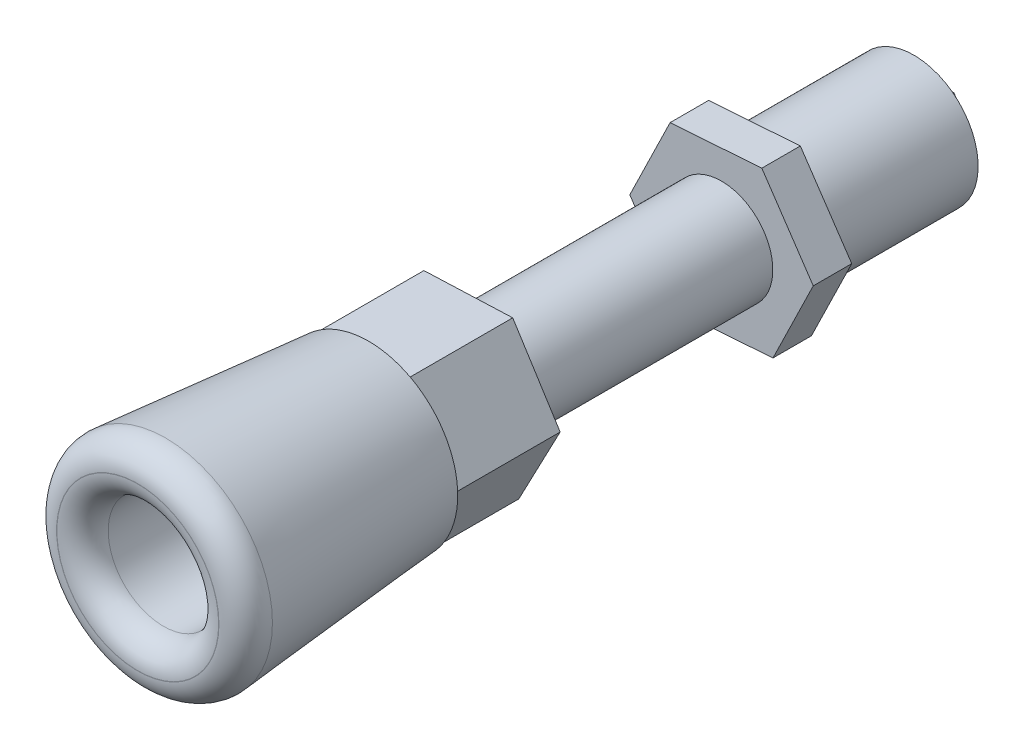
ISO-10303-21;
HEADER;
FILE_DESCRIPTION(('STEP AP214'),'2;1');
FILE_NAME('part.step','',(''),(''),'','','');
FILE_SCHEMA(('AUTOMOTIVE_DESIGN { 1 0 10303 214 1 1 1 1 }'));
ENDSEC;
DATA;
#1=APPLICATION_CONTEXT('core data for automotive mechanical design processes');
#2=APPLICATION_PROTOCOL_DEFINITION('international standard','automotive_design',2000,#1);
#3=PRODUCT_CONTEXT('',#1,'mechanical');
#4=PRODUCT('Part','Part','',(#3));
#5=PRODUCT_RELATED_PRODUCT_CATEGORY('part','',(#4));
#6=PRODUCT_DEFINITION_FORMATION('','',#4);
#7=PRODUCT_DEFINITION_CONTEXT('part definition',#1,'design');
#8=PRODUCT_DEFINITION('design','',#6,#7);
#9=PRODUCT_DEFINITION_SHAPE('','',#8);
#10=(LENGTH_UNIT() NAMED_UNIT(*) SI_UNIT(.MILLI.,.METRE.));
#11=(NAMED_UNIT(*) PLANE_ANGLE_UNIT() SI_UNIT($,.RADIAN.));
#12=(NAMED_UNIT(*) SI_UNIT($,.STERADIAN.) SOLID_ANGLE_UNIT());
#13=UNCERTAINTY_MEASURE_WITH_UNIT(LENGTH_MEASURE(1.E-05),#10,'distance_accuracy_value','');
#14=(GEOMETRIC_REPRESENTATION_CONTEXT(3) GLOBAL_UNCERTAINTY_ASSIGNED_CONTEXT((#13)) GLOBAL_UNIT_ASSIGNED_CONTEXT((#10,
#11,#12)) REPRESENTATION_CONTEXT('',''));
#15=CARTESIAN_POINT('',(0.,0.,0.));
#16=DIRECTION('',(0.,0.,1.));
#17=DIRECTION('',(1.,0.,0.));
#18=AXIS2_PLACEMENT_3D('',#15,#16,#17);
#19=CARTESIAN_POINT('',(3.22476404676581,6.13195701572399,8.));
#20=DIRECTION('',(0.0394403733652057,-0.999221925774657,0.));
#21=DIRECTION('',(0.999221925774657,0.0394403733652057,0.));
#22=AXIS2_PLACEMENT_3D('',#19,#20,#21);
#23=PLANE('',#22);
#24=DIRECTION('',(-0.999221925774657,-0.0394403733652057,0.));
#25=VECTOR('',#24,1.);
#26=CARTESIAN_POINT('',(3.22476404676581,6.13195701572399,0.));
#27=LINE('',#26,#25);
#28=CARTESIAN_POINT('',(3.22476404676581,6.13195701572399,0.));
#29=VERTEX_POINT('',#28);
#30=CARTESIAN_POINT('',(-3.69804852714828,5.8587060935719,0.));
#31=VERTEX_POINT('',#30);
#32=EDGE_CURVE('E202',#29,#31,#27,.T.);
#33=ORIENTED_EDGE('',*,*,#32,.T.);
#34=DIRECTION('',(0.,0.,-1.));
#35=VECTOR('',#34,1.);
#36=CARTESIAN_POINT('',(-3.69804852714828,5.8587060935719,8.));
#37=LINE('',#36,#35);
#38=CARTESIAN_POINT('',(-3.69804852714828,5.8587060935719,8.));
#39=VERTEX_POINT('',#38);
#40=EDGE_CURVE('E173',#39,#31,#37,.T.);
#41=ORIENTED_EDGE('',*,*,#40,.F.);
#42=DIRECTION('',(-0.999221925774657,-0.0394403733652057,0.));
#43=VECTOR('',#42,1.);
#44=CARTESIAN_POINT('',(3.22476404676581,6.13195701572399,8.));
#45=LINE('',#44,#43);
#46=CARTESIAN_POINT('',(3.22476404676581,6.13195701572399,8.));
#47=VERTEX_POINT('',#46);
#48=EDGE_CURVE('E167',#47,#39,#45,.T.);
#49=ORIENTED_EDGE('',*,*,#48,.F.);
#50=DIRECTION('',(0.,0.,-1.));
#51=VECTOR('',#50,1.);
#52=CARTESIAN_POINT('',(3.22476404676581,6.13195701572399,8.));
#53=LINE('',#52,#51);
#54=EDGE_CURVE('E170',#47,#29,#53,.T.);
#55=ORIENTED_EDGE('',*,*,#54,.T.);
#56=EDGE_LOOP('',(#33,#41,#49,#55));
#57=FACE_BOUND('',#56,.T.);
#58=ADVANCED_FACE('F41',(#57),#23,.F.);
#59=CARTESIAN_POINT('',(-3.69804852714828,5.8587060935719,8.));
#60=DIRECTION('',(0.885071758421864,-0.465454597618317,0.));
#61=DIRECTION('',(0.465454597618317,0.885071758421864,0.));
#62=AXIS2_PLACEMENT_3D('',#59,#60,#61);
#63=PLANE('',#62);
#64=DIRECTION('',(-0.465454597618317,-0.885071758421864,0.));
#65=VECTOR('',#64,1.);
#66=CARTESIAN_POINT('',(-3.69804852714828,5.8587060935719,0.));
#67=LINE('',#66,#65);
#68=CARTESIAN_POINT('',(-6.92281257391409,-0.27325092215209,0.));
#69=VERTEX_POINT('',#68);
#70=EDGE_CURVE('E205',#31,#69,#67,.T.);
#71=ORIENTED_EDGE('',*,*,#70,.T.);
#72=DIRECTION('',(0.,0.,-1.));
#73=VECTOR('',#72,1.);
#74=CARTESIAN_POINT('',(-6.92281257391409,-0.27325092215209,8.));
#75=LINE('',#74,#73);
#76=CARTESIAN_POINT('',(-6.92281257391409,-0.27325092215209,8.));
#77=VERTEX_POINT('',#76);
#78=EDGE_CURVE('E230',#77,#69,#75,.T.);
#79=ORIENTED_EDGE('',*,*,#78,.F.);
#80=DIRECTION('',(-0.465454597618317,-0.885071758421864,0.));
#81=VECTOR('',#80,1.);
#82=CARTESIAN_POINT('',(-3.69804852714828,5.8587060935719,8.));
#83=LINE('',#82,#81);
#84=EDGE_CURVE('E178',#39,#77,#83,.T.);
#85=ORIENTED_EDGE('',*,*,#84,.F.);
#86=ORIENTED_EDGE('',*,*,#40,.T.);
#87=EDGE_LOOP('',(#71,#79,#85,#86));
#88=FACE_BOUND('',#87,.T.);
#89=ADVANCED_FACE('F447',(#88),#63,.F.);
#90=CARTESIAN_POINT('',(-6.92281257391409,-0.27325092215209,8.));
#91=DIRECTION('',(0.845631385056658,0.53376732815634,0.));
#92=DIRECTION('',(-0.53376732815634,0.845631385056658,0.));
#93=AXIS2_PLACEMENT_3D('',#90,#91,#92);
#94=PLANE('',#93);
#95=DIRECTION('',(0.53376732815634,-0.845631385056658,0.));
#96=VECTOR('',#95,1.);
#97=CARTESIAN_POINT('',(-6.92281257391409,-0.27325092215209,0.));
#98=LINE('',#97,#96);
#99=CARTESIAN_POINT('',(-3.22476404676581,-6.13195701572399,0.));
#100=VERTEX_POINT('',#99);
#101=EDGE_CURVE('E209',#69,#100,#98,.T.);
#102=ORIENTED_EDGE('',*,*,#101,.T.);
#103=DIRECTION('',(0.,0.,-1.));
#104=VECTOR('',#103,1.);
#105=CARTESIAN_POINT('',(-3.22476404676581,-6.13195701572399,8.));
#106=LINE('',#105,#104);
#107=CARTESIAN_POINT('',(-3.22476404676581,-6.13195701572399,8.));
#108=VERTEX_POINT('',#107);
#109=EDGE_CURVE('E226',#108,#100,#106,.T.);
#110=ORIENTED_EDGE('',*,*,#109,.F.);
#111=DIRECTION('',(0.53376732815634,-0.845631385056658,0.));
#112=VECTOR('',#111,1.);
#113=CARTESIAN_POINT('',(-6.92281257391409,-0.27325092215209,8.));
#114=LINE('',#113,#112);
#115=EDGE_CURVE('E431',#77,#108,#114,.T.);
#116=ORIENTED_EDGE('',*,*,#115,.F.);
#117=ORIENTED_EDGE('',*,*,#78,.T.);
#118=EDGE_LOOP('',(#102,#110,#116,#117));
#119=FACE_BOUND('',#118,.T.);
#120=ADVANCED_FACE('F449',(#119),#94,.F.);
#121=CARTESIAN_POINT('',(-3.22476404676581,-6.13195701572399,8.));
#122=DIRECTION('',(-0.0394403733652064,0.999221925774656,0.));
#123=DIRECTION('',(-0.999221925774657,-0.0394403733652064,0.));
#124=AXIS2_PLACEMENT_3D('',#121,#122,#123);
#125=PLANE('',#124);
#126=DIRECTION('',(0.999221925774657,0.0394403733652064,0.));
#127=VECTOR('',#126,1.);
#128=CARTESIAN_POINT('',(-3.22476404676581,-6.13195701572399,0.));
#129=LINE('',#128,#127);
#130=CARTESIAN_POINT('',(3.69804852714828,-5.85870609357189,0.));
#131=VERTEX_POINT('',#130);
#132=EDGE_CURVE('E212',#100,#131,#129,.T.);
#133=ORIENTED_EDGE('',*,*,#132,.T.);
#134=DIRECTION('',(0.,0.,-1.));
#135=VECTOR('',#134,1.);
#136=CARTESIAN_POINT('',(3.69804852714828,-5.85870609357189,8.));
#137=LINE('',#136,#135);
#138=CARTESIAN_POINT('',(3.69804852714828,-5.85870609357189,8.));
#139=VERTEX_POINT('',#138);
#140=EDGE_CURVE('E222',#139,#131,#137,.T.);
#141=ORIENTED_EDGE('',*,*,#140,.F.);
#142=DIRECTION('',(0.999221925774657,0.0394403733652064,0.));
#143=VECTOR('',#142,1.);
#144=CARTESIAN_POINT('',(-3.22476404676581,-6.13195701572399,8.));
#145=LINE('',#144,#143);
#146=EDGE_CURVE('E198',#108,#139,#145,.T.);
#147=ORIENTED_EDGE('',*,*,#146,.F.);
#148=ORIENTED_EDGE('',*,*,#109,.T.);
#149=EDGE_LOOP('',(#133,#141,#147,#148));
#150=FACE_BOUND('',#149,.T.);
#151=ADVANCED_FACE('F438',(#150),#125,.F.);
#152=CARTESIAN_POINT('',(3.69804852714828,-5.85870609357189,8.));
#153=DIRECTION('',(-0.885071758421864,0.465454597618317,0.));
#154=DIRECTION('',(-0.465454597618317,-0.885071758421864,0.));
#155=AXIS2_PLACEMENT_3D('',#152,#153,#154);
#156=PLANE('',#155);
#157=DIRECTION('',(0.465454597618317,0.885071758421864,0.));
#158=VECTOR('',#157,1.);
#159=CARTESIAN_POINT('',(3.69804852714828,-5.85870609357189,0.));
#160=LINE('',#159,#158);
#161=CARTESIAN_POINT('',(6.92281257391409,0.273250922152091,0.));
#162=VERTEX_POINT('',#161);
#163=EDGE_CURVE('E215',#131,#162,#160,.T.);
#164=ORIENTED_EDGE('',*,*,#163,.T.);
#165=DIRECTION('',(0.,0.,-1.));
#166=VECTOR('',#165,1.);
#167=CARTESIAN_POINT('',(6.92281257391409,0.273250922152091,8.));
#168=LINE('',#167,#166);
#169=CARTESIAN_POINT('',(6.92281257391409,0.273250922152091,8.));
#170=VERTEX_POINT('',#169);
#171=EDGE_CURVE('E189',#170,#162,#168,.T.);
#172=ORIENTED_EDGE('',*,*,#171,.F.);
#173=DIRECTION('',(0.465454597618317,0.885071758421864,0.));
#174=VECTOR('',#173,1.);
#175=CARTESIAN_POINT('',(3.69804852714828,-5.85870609357189,8.));
#176=LINE('',#175,#174);
#177=EDGE_CURVE('E194',#139,#170,#176,.T.);
#178=ORIENTED_EDGE('',*,*,#177,.F.);
#179=ORIENTED_EDGE('',*,*,#140,.T.);
#180=EDGE_LOOP('',(#164,#172,#178,#179));
#181=FACE_BOUND('',#180,.T.);
#182=ADVANCED_FACE('F442',(#181),#156,.F.);
#183=CARTESIAN_POINT('',(6.92281257391409,0.273250922152091,8.));
#184=DIRECTION('',(-0.845631385056659,-0.53376732815634,0.));
#185=DIRECTION('',(0.53376732815634,-0.845631385056659,0.));
#186=AXIS2_PLACEMENT_3D('',#183,#184,#185);
#187=PLANE('',#186);
#188=DIRECTION('',(-0.533767328156339,0.845631385056658,0.));
#189=VECTOR('',#188,1.);
#190=CARTESIAN_POINT('',(6.92281257391409,0.273250922152091,0.));
#191=LINE('',#190,#189);
#192=EDGE_CURVE('E179',#162,#29,#191,.T.);
#193=ORIENTED_EDGE('',*,*,#192,.T.);
#194=ORIENTED_EDGE('',*,*,#54,.F.);
#195=DIRECTION('',(-0.533767328156339,0.845631385056658,0.));
#196=VECTOR('',#195,1.);
#197=CARTESIAN_POINT('',(6.92281257391409,0.273250922152091,8.));
#198=LINE('',#197,#196);
#199=EDGE_CURVE('E185',#170,#47,#198,.T.);
#200=ORIENTED_EDGE('',*,*,#199,.F.);
#201=ORIENTED_EDGE('',*,*,#171,.T.);
#202=EDGE_LOOP('',(#193,#194,#200,#201));
#203=FACE_BOUND('',#202,.T.);
#204=ADVANCED_FACE('F183',(#203),#187,.F.);
#205=CARTESIAN_POINT('',(0.,0.,0.));
#206=DIRECTION('',(0.,0.,1.));
#207=DIRECTION('',(1.,0.,0.));
#208=AXIS2_PLACEMENT_3D('',#205,#206,#207);
#209=PLANE('',#208);
#210=CARTESIAN_POINT('',(0.,0.,0.));
#211=DIRECTION('',(0.,0.,-1.));
#212=DIRECTION('',(-1.,0.,0.));
#213=AXIS2_PLACEMENT_3D('',#210,#211,#212);
#214=CIRCLE('',#213,4.);
#215=CARTESIAN_POINT('',(-4.,0.,0.));
#216=VERTEX_POINT('',#215);
#217=EDGE_CURVE('E236',#216,#216,#214,.T.);
#218=ORIENTED_EDGE('',*,*,#217,.F.);
#219=EDGE_LOOP('',(#218));
#220=FACE_BOUND('',#219,.T.);
#221=ORIENTED_EDGE('',*,*,#32,.F.);
#222=ORIENTED_EDGE('',*,*,#192,.F.);
#223=ORIENTED_EDGE('',*,*,#163,.F.);
#224=ORIENTED_EDGE('',*,*,#132,.F.);
#225=ORIENTED_EDGE('',*,*,#101,.F.);
#226=ORIENTED_EDGE('',*,*,#70,.F.);
#227=EDGE_LOOP('',(#221,#222,#223,#224,#225,#226));
#228=FACE_BOUND('',#227,.T.);
#229=ADVANCED_FACE('F444',(#220,#228),#209,.F.);
#230=CARTESIAN_POINT('',(0.,0.,-19.5));
#231=DIRECTION('',(0.,0.,1.));
#232=DIRECTION('',(1.,0.,0.));
#233=AXIS2_PLACEMENT_3D('',#230,#231,#232);
#234=CYLINDRICAL_SURFACE('',#233,4.);
#235=CARTESIAN_POINT('',(0.,0.,-19.5));
#236=DIRECTION('',(0.,0.,-1.));
#237=DIRECTION('',(-1.,0.,0.));
#238=AXIS2_PLACEMENT_3D('',#235,#236,#237);
#239=CIRCLE('',#238,4.);
#240=CARTESIAN_POINT('',(-4.,0.,-19.5));
#241=VERTEX_POINT('',#240);
#242=EDGE_CURVE('E206',#241,#241,#239,.T.);
#243=ORIENTED_EDGE('',*,*,#242,.F.);
#244=EDGE_LOOP('',(#243));
#245=FACE_BOUND('',#244,.T.);
#246=ORIENTED_EDGE('',*,*,#217,.T.);
#247=EDGE_LOOP('',(#246));
#248=FACE_BOUND('',#247,.T.);
#249=ADVANCED_FACE('F654',(#245,#248),#234,.T.);
#250=CARTESIAN_POINT('',(-7.1491974994049,-0.500118811012956,-22.5));
#251=DIRECTION('',(0.898806141269668,-0.438346347556278,0.));
#252=DIRECTION('',(0.438346347556278,0.898806141269668,0.));
#253=AXIS2_PLACEMENT_3D('',#250,#251,#252);
#254=PLANE('',#253);
#255=DIRECTION('',(0.438346347556278,0.898806141269668,0.));
#256=VECTOR('',#255,1.);
#257=CARTESIAN_POINT('',(-7.1491974994049,-0.500118811012956,-19.5));
#258=LINE('',#257,#256);
#259=CARTESIAN_POINT('',(-7.1491974994049,-0.500118811012956,-19.5));
#260=VERTEX_POINT('',#259);
#261=CARTESIAN_POINT('',(-4.00771434495014,5.94132724565035,-19.5));
#262=VERTEX_POINT('',#261);
#263=EDGE_CURVE('E358',#260,#262,#258,.T.);
#264=ORIENTED_EDGE('',*,*,#263,.T.);
#265=DIRECTION('',(0.,0.,1.));
#266=VECTOR('',#265,1.);
#267=CARTESIAN_POINT('',(-4.00771434495014,5.94132724565035,-22.5));
#268=LINE('',#267,#266);
#269=CARTESIAN_POINT('',(-4.00771434495014,5.94132724565035,-22.5));
#270=VERTEX_POINT('',#269);
#271=EDGE_CURVE('E419',#270,#262,#268,.T.);
#272=ORIENTED_EDGE('',*,*,#271,.F.);
#273=DIRECTION('',(0.438346347556278,0.898806141269668,0.));
#274=VECTOR('',#273,1.);
#275=CARTESIAN_POINT('',(-7.1491974994049,-0.500118811012956,-22.5));
#276=LINE('',#275,#274);
#277=CARTESIAN_POINT('',(-7.1491974994049,-0.500118811012956,-22.5));
#278=VERTEX_POINT('',#277);
#279=EDGE_CURVE('E362',#278,#270,#276,.T.);
#280=ORIENTED_EDGE('',*,*,#279,.F.);
#281=DIRECTION('',(0.,0.,1.));
#282=VECTOR('',#281,1.);
#283=CARTESIAN_POINT('',(-7.1491974994049,-0.500118811012956,-22.5));
#284=LINE('',#283,#282);
#285=EDGE_CURVE('E382',#278,#260,#284,.T.);
#286=ORIENTED_EDGE('',*,*,#285,.T.);
#287=EDGE_LOOP('',(#264,#272,#280,#286));
#288=FACE_BOUND('',#287,.T.);
#289=ADVANCED_FACE('F650',(#288),#254,.F.);
#290=CARTESIAN_POINT('',(-4.00771434495014,5.94132724565035,-22.5));
#291=DIRECTION('',(0.0697839979949747,-0.997562125195136,0.));
#292=DIRECTION('',(0.997562125195137,0.0697839979949747,0.));
#293=AXIS2_PLACEMENT_3D('',#290,#291,#292);
#294=PLANE('',#293);
#295=DIRECTION('',(0.997562125195137,0.0697839979949747,0.));
#296=VECTOR('',#295,1.);
#297=CARTESIAN_POINT('',(-4.00771434495014,5.94132724565035,-19.5));
#298=LINE('',#297,#296);
#299=CARTESIAN_POINT('',(3.14148315445476,6.44144605666331,-19.5));
#300=VERTEX_POINT('',#299);
#301=EDGE_CURVE('E386',#262,#300,#298,.T.);
#302=ORIENTED_EDGE('',*,*,#301,.T.);
#303=DIRECTION('',(0.,0.,1.));
#304=VECTOR('',#303,1.);
#305=CARTESIAN_POINT('',(3.14148315445476,6.44144605666331,-22.5));
#306=LINE('',#305,#304);
#307=CARTESIAN_POINT('',(3.14148315445476,6.44144605666331,-22.5));
#308=VERTEX_POINT('',#307);
#309=EDGE_CURVE('E415',#308,#300,#306,.T.);
#310=ORIENTED_EDGE('',*,*,#309,.F.);
#311=DIRECTION('',(0.997562125195137,0.0697839979949747,0.));
#312=VECTOR('',#311,1.);
#313=CARTESIAN_POINT('',(-4.00771434495014,5.94132724565035,-22.5));
#314=LINE('',#313,#312);
#315=EDGE_CURVE('E366',#270,#308,#314,.T.);
#316=ORIENTED_EDGE('',*,*,#315,.F.);
#317=ORIENTED_EDGE('',*,*,#271,.T.);
#318=EDGE_LOOP('',(#302,#310,#316,#317));
#319=FACE_BOUND('',#318,.T.);
#320=ADVANCED_FACE('F646',(#319),#294,.F.);
#321=CARTESIAN_POINT('',(3.14148315445476,6.44144605666331,-22.5));
#322=DIRECTION('',(-0.829022143274694,-0.559215777638858,0.));
#323=DIRECTION('',(0.559215777638858,-0.829022143274694,0.));
#324=AXIS2_PLACEMENT_3D('',#321,#322,#323);
#325=PLANE('',#324);
#326=DIRECTION('',(0.559215777638858,-0.829022143274694,0.));
#327=VECTOR('',#326,1.);
#328=CARTESIAN_POINT('',(3.14148315445476,6.44144605666331,-19.5));
#329=LINE('',#328,#327);
#330=CARTESIAN_POINT('',(7.1491974994049,0.500118811012955,-19.5));
#331=VERTEX_POINT('',#330);
#332=EDGE_CURVE('E389',#300,#331,#329,.T.);
#333=ORIENTED_EDGE('',*,*,#332,.T.);
#334=DIRECTION('',(0.,0.,1.));
#335=VECTOR('',#334,1.);
#336=CARTESIAN_POINT('',(7.1491974994049,0.500118811012955,-22.5));
#337=LINE('',#336,#335);
#338=CARTESIAN_POINT('',(7.1491974994049,0.500118811012955,-22.5));
#339=VERTEX_POINT('',#338);
#340=EDGE_CURVE('E411',#339,#331,#337,.T.);
#341=ORIENTED_EDGE('',*,*,#340,.F.);
#342=DIRECTION('',(0.559215777638858,-0.829022143274694,0.));
#343=VECTOR('',#342,1.);
#344=CARTESIAN_POINT('',(3.14148315445476,6.44144605666331,-22.5));
#345=LINE('',#344,#343);
#346=EDGE_CURVE('E370',#308,#339,#345,.T.);
#347=ORIENTED_EDGE('',*,*,#346,.F.);
#348=ORIENTED_EDGE('',*,*,#309,.T.);
#349=EDGE_LOOP('',(#333,#341,#347,#348));
#350=FACE_BOUND('',#349,.T.);
#351=ADVANCED_FACE('F642',(#350),#325,.F.);
#352=CARTESIAN_POINT('',(7.1491974994049,0.500118811012955,-22.5));
#353=DIRECTION('',(-0.898806141269668,0.438346347556278,0.));
#354=DIRECTION('',(-0.438346347556278,-0.898806141269668,0.));
#355=AXIS2_PLACEMENT_3D('',#352,#353,#354);
#356=PLANE('',#355);
#357=DIRECTION('',(-0.438346347556278,-0.898806141269668,0.));
#358=VECTOR('',#357,1.);
#359=CARTESIAN_POINT('',(7.1491974994049,0.500118811012955,-19.5));
#360=LINE('',#359,#358);
#361=CARTESIAN_POINT('',(4.00771434495013,-5.94132724565035,-19.5));
#362=VERTEX_POINT('',#361);
#363=EDGE_CURVE('E392',#331,#362,#360,.T.);
#364=ORIENTED_EDGE('',*,*,#363,.T.);
#365=DIRECTION('',(0.,0.,1.));
#366=VECTOR('',#365,1.);
#367=CARTESIAN_POINT('',(4.00771434495013,-5.94132724565035,-22.5));
#368=LINE('',#367,#366);
#369=CARTESIAN_POINT('',(4.00771434495013,-5.94132724565035,-22.5));
#370=VERTEX_POINT('',#369);
#371=EDGE_CURVE('E407',#370,#362,#368,.T.);
#372=ORIENTED_EDGE('',*,*,#371,.F.);
#373=DIRECTION('',(-0.438346347556278,-0.898806141269668,0.));
#374=VECTOR('',#373,1.);
#375=CARTESIAN_POINT('',(7.1491974994049,0.500118811012955,-22.5));
#376=LINE('',#375,#374);
#377=EDGE_CURVE('E373',#339,#370,#376,.T.);
#378=ORIENTED_EDGE('',*,*,#377,.F.);
#379=ORIENTED_EDGE('',*,*,#340,.T.);
#380=EDGE_LOOP('',(#364,#372,#378,#379));
#381=FACE_BOUND('',#380,.T.);
#382=ADVANCED_FACE('F638',(#381),#356,.F.);
#383=CARTESIAN_POINT('',(4.00771434495013,-5.94132724565035,-22.5));
#384=DIRECTION('',(-0.069783997994975,0.997562125195137,0.));
#385=DIRECTION('',(-0.997562125195137,-0.069783997994975,0.));
#386=AXIS2_PLACEMENT_3D('',#383,#384,#385);
#387=PLANE('',#386);
#388=DIRECTION('',(-0.997562125195137,-0.069783997994975,0.));
#389=VECTOR('',#388,1.);
#390=CARTESIAN_POINT('',(4.00771434495013,-5.94132724565035,-19.5));
#391=LINE('',#390,#389);
#392=CARTESIAN_POINT('',(-3.14148315445476,-6.44144605666331,-19.5));
#393=VERTEX_POINT('',#392);
#394=EDGE_CURVE('E395',#362,#393,#391,.T.);
#395=ORIENTED_EDGE('',*,*,#394,.T.);
#396=DIRECTION('',(0.,0.,1.));
#397=VECTOR('',#396,1.);
#398=CARTESIAN_POINT('',(-3.14148315445476,-6.44144605666331,-22.5));
#399=LINE('',#398,#397);
#400=CARTESIAN_POINT('',(-3.14148315445476,-6.44144605666331,-22.5));
#401=VERTEX_POINT('',#400);
#402=EDGE_CURVE('E403',#401,#393,#399,.T.);
#403=ORIENTED_EDGE('',*,*,#402,.F.);
#404=DIRECTION('',(-0.997562125195137,-0.069783997994975,0.));
#405=VECTOR('',#404,1.);
#406=CARTESIAN_POINT('',(4.00771434495013,-5.94132724565035,-22.5));
#407=LINE('',#406,#405);
#408=EDGE_CURVE('E376',#370,#401,#407,.T.);
#409=ORIENTED_EDGE('',*,*,#408,.F.);
#410=ORIENTED_EDGE('',*,*,#371,.T.);
#411=EDGE_LOOP('',(#395,#403,#409,#410));
#412=FACE_BOUND('',#411,.T.);
#413=ADVANCED_FACE('F634',(#412),#387,.F.);
#414=CARTESIAN_POINT('',(-3.14148315445476,-6.44144605666331,-22.5));
#415=DIRECTION('',(0.829022143274694,0.559215777638859,0.));
#416=DIRECTION('',(-0.559215777638859,0.829022143274694,0.));
#417=AXIS2_PLACEMENT_3D('',#414,#415,#416);
#418=PLANE('',#417);
#419=DIRECTION('',(-0.559215777638859,0.829022143274693,0.));
#420=VECTOR('',#419,1.);
#421=CARTESIAN_POINT('',(-3.14148315445476,-6.44144605666331,-19.5));
#422=LINE('',#421,#420);
#423=EDGE_CURVE('E367',#393,#260,#422,.T.);
#424=ORIENTED_EDGE('',*,*,#423,.T.);
#425=ORIENTED_EDGE('',*,*,#285,.F.);
#426=DIRECTION('',(-0.559215777638859,0.829022143274693,0.));
#427=VECTOR('',#426,1.);
#428=CARTESIAN_POINT('',(-3.14148315445476,-6.44144605666331,-22.5));
#429=LINE('',#428,#427);
#430=EDGE_CURVE('E379',#401,#278,#429,.T.);
#431=ORIENTED_EDGE('',*,*,#430,.F.);
#432=ORIENTED_EDGE('',*,*,#402,.T.);
#433=EDGE_LOOP('',(#424,#425,#431,#432));
#434=FACE_BOUND('',#433,.T.);
#435=ADVANCED_FACE('F627',(#434),#418,.F.);
#436=CARTESIAN_POINT('',(0.,0.,-22.5));
#437=DIRECTION('',(0.,0.,-1.));
#438=DIRECTION('',(-1.,0.,0.));
#439=AXIS2_PLACEMENT_3D('',#436,#437,#438);
#440=PLANE('',#439);
#441=CARTESIAN_POINT('',(0.,0.,-22.5));
#442=DIRECTION('',(0.,0.,-1.));
#443=DIRECTION('',(-1.,0.,0.));
#444=AXIS2_PLACEMENT_3D('',#441,#442,#443);
#445=CIRCLE('',#444,5.);
#446=CARTESIAN_POINT('',(-5.,0.,-22.5));
#447=VERTEX_POINT('',#446);
#448=EDGE_CURVE('E242',#447,#447,#445,.T.);
#449=ORIENTED_EDGE('',*,*,#448,.F.);
#450=EDGE_LOOP('',(#449));
#451=FACE_BOUND('',#450,.T.);
#452=ORIENTED_EDGE('',*,*,#279,.T.);
#453=ORIENTED_EDGE('',*,*,#315,.T.);
#454=ORIENTED_EDGE('',*,*,#346,.T.);
#455=ORIENTED_EDGE('',*,*,#377,.T.);
#456=ORIENTED_EDGE('',*,*,#408,.T.);
#457=ORIENTED_EDGE('',*,*,#430,.T.);
#458=EDGE_LOOP('',(#452,#453,#454,#455,#456,#457));
#459=FACE_BOUND('',#458,.T.);
#460=ADVANCED_FACE('F624',(#451,#459),#440,.T.);
#461=CARTESIAN_POINT('',(0.,0.,-19.5));
#462=DIRECTION('',(0.,0.,-1.));
#463=DIRECTION('',(-1.,0.,0.));
#464=AXIS2_PLACEMENT_3D('',#461,#462,#463);
#465=PLANE('',#464);
#466=ORIENTED_EDGE('',*,*,#242,.T.);
#467=EDGE_LOOP('',(#466));
#468=FACE_BOUND('',#467,.T.);
#469=ORIENTED_EDGE('',*,*,#263,.F.);
#470=ORIENTED_EDGE('',*,*,#423,.F.);
#471=ORIENTED_EDGE('',*,*,#394,.F.);
#472=ORIENTED_EDGE('',*,*,#363,.F.);
#473=ORIENTED_EDGE('',*,*,#332,.F.);
#474=ORIENTED_EDGE('',*,*,#301,.F.);
#475=EDGE_LOOP('',(#469,#470,#471,#472,#473,#474));
#476=FACE_BOUND('',#475,.T.);
#477=ADVANCED_FACE('F622',(#468,#476),#465,.F.);
#478=CARTESIAN_POINT('',(0.,0.,-34.5));
#479=DIRECTION('',(0.,0.,1.));
#480=DIRECTION('',(1.,0.,0.));
#481=AXIS2_PLACEMENT_3D('',#478,#479,#480);
#482=CYLINDRICAL_SURFACE('',#481,5.);
#483=CARTESIAN_POINT('',(0.,0.,-34.5));
#484=DIRECTION('',(0.,0.,-1.));
#485=DIRECTION('',(-1.,0.,0.));
#486=AXIS2_PLACEMENT_3D('',#483,#484,#485);
#487=CIRCLE('',#486,5.);
#488=CARTESIAN_POINT('',(-5.,0.,-34.5));
#489=VERTEX_POINT('',#488);
#490=EDGE_CURVE('E354',#489,#489,#487,.T.);
#491=ORIENTED_EDGE('',*,*,#490,.F.);
#492=EDGE_LOOP('',(#491));
#493=FACE_BOUND('',#492,.T.);
#494=ORIENTED_EDGE('',*,*,#448,.T.);
#495=EDGE_LOOP('',(#494));
#496=FACE_BOUND('',#495,.T.);
#497=ADVANCED_FACE('F619',(#493,#496),#482,.T.);
#498=CARTESIAN_POINT('',(0.,0.,-34.5));
#499=DIRECTION('',(0.,0.,-1.));
#500=DIRECTION('',(-1.,0.,0.));
#501=AXIS2_PLACEMENT_3D('',#498,#499,#500);
#502=PLANE('',#501);
#503=DIRECTION('',(0.485853323762416,0.874040358215233,0.));
#504=VECTOR('',#503,1.);
#505=CARTESIAN_POINT('',(-2.30909581095228,-0.0375482246714903,-34.5));
#506=LINE('',#505,#504);
#507=CARTESIAN_POINT('',(-2.30909581095228,-0.0375482246714903,-34.5));
#508=VERTEX_POINT('',#507);
#509=CARTESIAN_POINT('',(-1.18706562190865,1.98096151972116,-34.5));
#510=VERTEX_POINT('',#509);
#511=EDGE_CURVE('E58',#508,#510,#506,.T.);
#512=ORIENTED_EDGE('',*,*,#511,.F.);
#513=DIRECTION('',(-0.514014492266034,0.857781499998975,0.));
#514=VECTOR('',#513,1.);
#515=CARTESIAN_POINT('',(-1.12203018904362,-2.01850974439265,-34.5));
#516=LINE('',#515,#514);
#517=CARTESIAN_POINT('',(-1.12203018904362,-2.01850974439265,-34.5));
#518=VERTEX_POINT('',#517);
#519=EDGE_CURVE('E62',#518,#508,#516,.T.);
#520=ORIENTED_EDGE('',*,*,#519,.F.);
#521=DIRECTION('',(-0.999867816028451,-0.0162588582162579,0.));
#522=VECTOR('',#521,1.);
#523=CARTESIAN_POINT('',(1.18706562190865,-1.98096151972116,-34.5));
#524=LINE('',#523,#522);
#525=CARTESIAN_POINT('',(1.18706562190865,-1.98096151972116,-34.5));
#526=VERTEX_POINT('',#525);
#527=EDGE_CURVE('E326',#526,#518,#524,.T.);
#528=ORIENTED_EDGE('',*,*,#527,.F.);
#529=DIRECTION('',(-0.485853323762417,-0.874040358215233,0.));
#530=VECTOR('',#529,1.);
#531=CARTESIAN_POINT('',(2.30909581095228,0.0375482246714894,-34.5));
#532=LINE('',#531,#530);
#533=CARTESIAN_POINT('',(2.30909581095228,0.0375482246714894,-34.5));
#534=VERTEX_POINT('',#533);
#535=EDGE_CURVE('E322',#534,#526,#532,.T.);
#536=ORIENTED_EDGE('',*,*,#535,.F.);
#537=DIRECTION('',(0.514014492266034,-0.857781499998975,0.));
#538=VECTOR('',#537,1.);
#539=CARTESIAN_POINT('',(1.12203018904362,2.01850974439265,-34.5));
#540=LINE('',#539,#538);
#541=CARTESIAN_POINT('',(1.12203018904362,2.01850974439265,-34.5));
#542=VERTEX_POINT('',#541);
#543=EDGE_CURVE('E318',#542,#534,#540,.T.);
#544=ORIENTED_EDGE('',*,*,#543,.F.);
#545=DIRECTION('',(0.999867816028451,0.0162588582162581,0.));
#546=VECTOR('',#545,1.);
#547=CARTESIAN_POINT('',(-1.18706562190865,1.98096151972116,-34.5));
#548=LINE('',#547,#546);
#549=EDGE_CURVE('E314',#510,#542,#548,.T.);
#550=ORIENTED_EDGE('',*,*,#549,.F.);
#551=EDGE_LOOP('',(#512,#520,#528,#536,#544,#550));
#552=FACE_BOUND('',#551,.T.);
#553=ORIENTED_EDGE('',*,*,#490,.T.);
#554=EDGE_LOOP('',(#553));
#555=FACE_BOUND('',#554,.T.);
#556=ADVANCED_FACE('F615',(#552,#555),#502,.T.);
#557=CARTESIAN_POINT('',(-2.30909581095228,-0.0375482246714903,-36.5));
#558=DIRECTION('',(0.874040358215233,-0.485853323762416,0.));
#559=DIRECTION('',(0.485853323762416,0.874040358215233,0.));
#560=AXIS2_PLACEMENT_3D('',#557,#558,#559);
#561=PLANE('',#560);
#562=ORIENTED_EDGE('',*,*,#511,.T.);
#563=DIRECTION('',(0.,0.,1.));
#564=VECTOR('',#563,1.);
#565=CARTESIAN_POINT('',(-1.18706562190865,1.98096151972116,-36.5));
#566=LINE('',#565,#564);
#567=CARTESIAN_POINT('',(-1.18706562190865,1.98096151972116,-36.5));
#568=VERTEX_POINT('',#567);
#569=EDGE_CURVE('E350',#568,#510,#566,.T.);
#570=ORIENTED_EDGE('',*,*,#569,.F.);
#571=DIRECTION('',(0.485853323762416,0.874040358215233,0.));
#572=VECTOR('',#571,1.);
#573=CARTESIAN_POINT('',(-2.30909581095228,-0.0375482246714903,-36.5));
#574=LINE('',#573,#572);
#575=CARTESIAN_POINT('',(-2.30909581095228,-0.0375482246714903,-36.5));
#576=VERTEX_POINT('',#575);
#577=EDGE_CURVE('E292',#576,#568,#574,.T.);
#578=ORIENTED_EDGE('',*,*,#577,.F.);
#579=DIRECTION('',(0.,0.,1.));
#580=VECTOR('',#579,1.);
#581=CARTESIAN_POINT('',(-2.30909581095228,-0.0375482246714903,-36.5));
#582=LINE('',#581,#580);
#583=EDGE_CURVE('E311',#576,#508,#582,.T.);
#584=ORIENTED_EDGE('',*,*,#583,.T.);
#585=EDGE_LOOP('',(#562,#570,#578,#584));
#586=FACE_BOUND('',#585,.T.);
#587=ADVANCED_FACE('F611',(#586),#561,.F.);
#588=CARTESIAN_POINT('',(-1.18706562190865,1.98096151972116,-36.5));
#589=DIRECTION('',(0.0162588582162581,-0.999867816028451,0.));
#590=DIRECTION('',(0.999867816028451,0.0162588582162581,0.));
#591=AXIS2_PLACEMENT_3D('',#588,#589,#590);
#592=PLANE('',#591);
#593=ORIENTED_EDGE('',*,*,#549,.T.);
#594=DIRECTION('',(0.,0.,1.));
#595=VECTOR('',#594,1.);
#596=CARTESIAN_POINT('',(1.12203018904362,2.01850974439265,-36.5));
#597=LINE('',#596,#595);
#598=CARTESIAN_POINT('',(1.12203018904362,2.01850974439265,-36.5));
#599=VERTEX_POINT('',#598);
#600=EDGE_CURVE('E346',#599,#542,#597,.T.);
#601=ORIENTED_EDGE('',*,*,#600,.F.);
#602=DIRECTION('',(0.999867816028451,0.0162588582162581,0.));
#603=VECTOR('',#602,1.);
#604=CARTESIAN_POINT('',(-1.18706562190865,1.98096151972116,-36.5));
#605=LINE('',#604,#603);
#606=EDGE_CURVE('E296',#568,#599,#605,.T.);
#607=ORIENTED_EDGE('',*,*,#606,.F.);
#608=ORIENTED_EDGE('',*,*,#569,.T.);
#609=EDGE_LOOP('',(#593,#601,#607,#608));
#610=FACE_BOUND('',#609,.T.);
#611=ADVANCED_FACE('F607',(#610),#592,.F.);
#612=CARTESIAN_POINT('',(1.12203018904362,2.01850974439265,-36.5));
#613=DIRECTION('',(-0.857781499998975,-0.514014492266034,0.));
#614=DIRECTION('',(0.514014492266034,-0.857781499998975,0.));
#615=AXIS2_PLACEMENT_3D('',#612,#613,#614);
#616=PLANE('',#615);
#617=ORIENTED_EDGE('',*,*,#543,.T.);
#618=DIRECTION('',(0.,0.,1.));
#619=VECTOR('',#618,1.);
#620=CARTESIAN_POINT('',(2.30909581095228,0.0375482246714894,-36.5));
#621=LINE('',#620,#619);
#622=CARTESIAN_POINT('',(2.30909581095228,0.0375482246714894,-36.5));
#623=VERTEX_POINT('',#622);
#624=EDGE_CURVE('E342',#623,#534,#621,.T.);
#625=ORIENTED_EDGE('',*,*,#624,.F.);
#626=DIRECTION('',(0.514014492266034,-0.857781499998975,0.));
#627=VECTOR('',#626,1.);
#628=CARTESIAN_POINT('',(1.12203018904362,2.01850974439265,-36.5));
#629=LINE('',#628,#627);
#630=EDGE_CURVE('E299',#599,#623,#629,.T.);
#631=ORIENTED_EDGE('',*,*,#630,.F.);
#632=ORIENTED_EDGE('',*,*,#600,.T.);
#633=EDGE_LOOP('',(#617,#625,#631,#632));
#634=FACE_BOUND('',#633,.T.);
#635=ADVANCED_FACE('F603',(#634),#616,.F.);
#636=CARTESIAN_POINT('',(2.30909581095228,0.0375482246714894,-36.5));
#637=DIRECTION('',(-0.874040358215233,0.485853323762417,0.));
#638=DIRECTION('',(-0.485853323762417,-0.874040358215233,0.));
#639=AXIS2_PLACEMENT_3D('',#636,#637,#638);
#640=PLANE('',#639);
#641=ORIENTED_EDGE('',*,*,#535,.T.);
#642=DIRECTION('',(0.,0.,1.));
#643=VECTOR('',#642,1.);
#644=CARTESIAN_POINT('',(1.18706562190865,-1.98096151972116,-36.5));
#645=LINE('',#644,#643);
#646=CARTESIAN_POINT('',(1.18706562190865,-1.98096151972116,-36.5));
#647=VERTEX_POINT('',#646);
#648=EDGE_CURVE('E338',#647,#526,#645,.T.);
#649=ORIENTED_EDGE('',*,*,#648,.F.);
#650=DIRECTION('',(-0.485853323762417,-0.874040358215233,0.));
#651=VECTOR('',#650,1.);
#652=CARTESIAN_POINT('',(2.30909581095228,0.0375482246714894,-36.5));
#653=LINE('',#652,#651);
#654=EDGE_CURVE('E302',#623,#647,#653,.T.);
#655=ORIENTED_EDGE('',*,*,#654,.F.);
#656=ORIENTED_EDGE('',*,*,#624,.T.);
#657=EDGE_LOOP('',(#641,#649,#655,#656));
#658=FACE_BOUND('',#657,.T.);
#659=ADVANCED_FACE('F599',(#658),#640,.F.);
#660=CARTESIAN_POINT('',(1.18706562190865,-1.98096151972116,-36.5));
#661=DIRECTION('',(-0.0162588582162579,0.999867816028451,0.));
#662=DIRECTION('',(-0.999867816028451,-0.0162588582162579,0.));
#663=AXIS2_PLACEMENT_3D('',#660,#661,#662);
#664=PLANE('',#663);
#665=ORIENTED_EDGE('',*,*,#527,.T.);
#666=DIRECTION('',(0.,0.,1.));
#667=VECTOR('',#666,1.);
#668=CARTESIAN_POINT('',(-1.12203018904362,-2.01850974439265,-36.5));
#669=LINE('',#668,#667);
#670=CARTESIAN_POINT('',(-1.12203018904362,-2.01850974439265,-36.5));
#671=VERTEX_POINT('',#670);
#672=EDGE_CURVE('E334',#671,#518,#669,.T.);
#673=ORIENTED_EDGE('',*,*,#672,.F.);
#674=DIRECTION('',(-0.999867816028451,-0.0162588582162579,0.));
#675=VECTOR('',#674,1.);
#676=CARTESIAN_POINT('',(1.18706562190865,-1.98096151972116,-36.5));
#677=LINE('',#676,#675);
#678=EDGE_CURVE('E305',#647,#671,#677,.T.);
#679=ORIENTED_EDGE('',*,*,#678,.F.);
#680=ORIENTED_EDGE('',*,*,#648,.T.);
#681=EDGE_LOOP('',(#665,#673,#679,#680));
#682=FACE_BOUND('',#681,.T.);
#683=ADVANCED_FACE('F595',(#682),#664,.F.);
#684=CARTESIAN_POINT('',(-1.12203018904362,-2.01850974439265,-36.5));
#685=DIRECTION('',(0.857781499998975,0.514014492266034,0.));
#686=DIRECTION('',(-0.514014492266034,0.857781499998975,0.));
#687=AXIS2_PLACEMENT_3D('',#684,#685,#686);
#688=PLANE('',#687);
#689=ORIENTED_EDGE('',*,*,#519,.T.);
#690=ORIENTED_EDGE('',*,*,#583,.F.);
#691=DIRECTION('',(-0.514014492266034,0.857781499998975,0.));
#692=VECTOR('',#691,1.);
#693=CARTESIAN_POINT('',(-1.12203018904362,-2.01850974439265,-36.5));
#694=LINE('',#693,#692);
#695=EDGE_CURVE('E308',#671,#576,#694,.T.);
#696=ORIENTED_EDGE('',*,*,#695,.F.);
#697=ORIENTED_EDGE('',*,*,#672,.T.);
#698=EDGE_LOOP('',(#689,#690,#696,#697));
#699=FACE_BOUND('',#698,.T.);
#700=ADVANCED_FACE('F570',(#699),#688,.F.);
#701=CARTESIAN_POINT('',(0.,0.,-36.5));
#702=DIRECTION('',(0.,0.,-1.));
#703=DIRECTION('',(-1.,0.,0.));
#704=AXIS2_PLACEMENT_3D('',#701,#702,#703);
#705=PLANE('',#704);
#706=CARTESIAN_POINT('',(0.,0.,-36.5));
#707=DIRECTION('',(0.,0.,-1.));
#708=DIRECTION('',(-1.,0.,0.));
#709=AXIS2_PLACEMENT_3D('',#706,#707,#708);
#710=CIRCLE('',#709,0.923714741759341);
#711=CARTESIAN_POINT('',(-0.923714741759341,0.,-36.5));
#712=VERTEX_POINT('',#711);
#713=EDGE_CURVE('E805',#712,#712,#710,.T.);
#714=ORIENTED_EDGE('',*,*,#713,.F.);
#715=EDGE_LOOP('',(#714));
#716=FACE_BOUND('',#715,.T.);
#717=ORIENTED_EDGE('',*,*,#577,.T.);
#718=ORIENTED_EDGE('',*,*,#606,.T.);
#719=ORIENTED_EDGE('',*,*,#630,.T.);
#720=ORIENTED_EDGE('',*,*,#654,.T.);
#721=ORIENTED_EDGE('',*,*,#678,.T.);
#722=ORIENTED_EDGE('',*,*,#695,.T.);
#723=EDGE_LOOP('',(#717,#718,#719,#720,#721,#722));
#724=FACE_BOUND('',#723,.T.);
#725=ADVANCED_FACE('F504',(#716,#724),#705,.T.);
#726=CARTESIAN_POINT('',(0.,0.,8.));
#727=DIRECTION('',(0.,0.,1.));
#728=DIRECTION('',(1.,0.,0.));
#729=AXIS2_PLACEMENT_3D('',#726,#727,#728);
#730=PLANE('',#729);
#731=CARTESIAN_POINT('',(0.,0.,8.));
#732=DIRECTION('',(0.,0.,1.));
#733=DIRECTION('',(1.,0.,0.));
#734=AXIS2_PLACEMENT_3D('',#731,#732,#733);
#735=CIRCLE('',#734,6.93707786055413);
#736=CARTESIAN_POINT('',(6.93707786055413,0.,8.));
#737=VERTEX_POINT('',#736);
#738=EDGE_CURVE('E280',#737,#737,#735,.T.);
#739=ORIENTED_EDGE('',*,*,#738,.F.);
#740=EDGE_LOOP('',(#739));
#741=FACE_BOUND('',#740,.T.);
#742=ORIENTED_EDGE('',*,*,#199,.T.);
#743=ORIENTED_EDGE('',*,*,#48,.T.);
#744=ORIENTED_EDGE('',*,*,#84,.T.);
#745=ORIENTED_EDGE('',*,*,#115,.T.);
#746=ORIENTED_EDGE('',*,*,#146,.T.);
#747=ORIENTED_EDGE('',*,*,#177,.T.);
#748=EDGE_LOOP('',(#742,#743,#744,#745,#746,#747));
#749=FACE_BOUND('',#748,.T.);
#750=ADVANCED_FACE('F191',(#741,#749),#730,.F.);
#751=CARTESIAN_POINT('',(0.,0.,8.));
#752=DIRECTION('',(0.,0.,1.));
#753=DIRECTION('',(1.,0.,0.));
#754=AXIS2_PLACEMENT_3D('',#751,#752,#753);
#755=CONICAL_SURFACE('',#754,6.93707786055413,0.0872664625997167);
#756=CARTESIAN_POINT('',(0.,0.,23.8256885145047));
#757=DIRECTION('',(0.,0.,1.));
#758=DIRECTION('',(1.,0.,0.));
#759=AXIS2_PLACEMENT_3D('',#756,#757,#758);
#760=CIRCLE('',#759,8.32164619806571);
#761=CARTESIAN_POINT('',(8.32164619806571,0.,23.8256885145047));
#762=VERTEX_POINT('',#761);
#763=EDGE_CURVE('E51',#762,#762,#760,.F.);
#764=ORIENTED_EDGE('',*,*,#763,.T.);
#765=EDGE_LOOP('',(#764));
#766=FACE_BOUND('',#765,.T.);
#767=ORIENTED_EDGE('',*,*,#738,.T.);
#768=EDGE_LOOP('',(#767));
#769=FACE_BOUND('',#768,.T.);
#770=ADVANCED_FACE('F250',(#766,#769),#755,.T.);
#771=CARTESIAN_POINT('',(0.,0.,26.));
#772=DIRECTION('',(0.,0.,1.));
#773=DIRECTION('',(1.,0.,0.));
#774=AXIS2_PLACEMENT_3D('',#771,#772,#773);
#775=PLANE('',#774);
#776=CARTESIAN_POINT('',(0.,0.,26.));
#777=DIRECTION('',(0.,0.,1.));
#778=DIRECTION('',(1.,0.,0.));
#779=AXIS2_PLACEMENT_3D('',#776,#777,#778);
#780=CIRCLE('',#779,6.32925680188222);
#781=CARTESIAN_POINT('',(6.32925680188222,0.,26.));
#782=VERTEX_POINT('',#781);
#783=EDGE_CURVE('E241',#782,#782,#780,.T.);
#784=ORIENTED_EDGE('',*,*,#783,.T.);
#785=EDGE_LOOP('',(#784));
#786=FACE_BOUND('',#785,.T.);
#787=CARTESIAN_POINT('',(0.,0.,26.));
#788=DIRECTION('',(0.,0.,1.));
#789=DIRECTION('',(1.,0.,0.));
#790=AXIS2_PLACEMENT_3D('',#787,#788,#789);
#791=CIRCLE('',#790,6.30381572746429);
#792=CARTESIAN_POINT('',(6.30381572746429,0.,26.));
#793=VERTEX_POINT('',#792);
#794=EDGE_CURVE('E237',#793,#793,#791,.F.);
#795=ORIENTED_EDGE('',*,*,#794,.T.);
#796=EDGE_LOOP('',(#795));
#797=FACE_BOUND('',#796,.T.);
#798=ADVANCED_FACE('F259',(#786,#797),#775,.T.);
#799=CARTESIAN_POINT('',(0.,0.,8.));
#800=DIRECTION('',(0.,0.,1.));
#801=DIRECTION('',(1.,0.,0.));
#802=AXIS2_PLACEMENT_3D('',#799,#800,#801);
#803=CYLINDRICAL_SURFACE('',#802,4.30381572746429);
#804=CARTESIAN_POINT('',(0.,0.,24.));
#805=DIRECTION('',(0.,0.,1.));
#806=DIRECTION('',(1.,0.,0.));
#807=AXIS2_PLACEMENT_3D('',#804,#805,#806);
#808=CIRCLE('',#807,4.30381572746429);
#809=CARTESIAN_POINT('',(4.30381572746429,0.,24.));
#810=VERTEX_POINT('',#809);
#811=EDGE_CURVE('E11',#810,#810,#808,.T.);
#812=ORIENTED_EDGE('',*,*,#811,.T.);
#813=EDGE_LOOP('',(#812));
#814=FACE_BOUND('',#813,.T.);
#815=CARTESIAN_POINT('',(0.,0.,8.));
#816=DIRECTION('',(0.,0.,1.));
#817=DIRECTION('',(1.,0.,0.));
#818=AXIS2_PLACEMENT_3D('',#815,#816,#817);
#819=CIRCLE('',#818,4.30381572746429);
#820=CARTESIAN_POINT('',(4.30381572746429,0.,8.));
#821=VERTEX_POINT('',#820);
#822=EDGE_CURVE('E277',#821,#821,#819,.T.);
#823=ORIENTED_EDGE('',*,*,#822,.F.);
#824=EDGE_LOOP('',(#823));
#825=FACE_BOUND('',#824,.T.);
#826=ADVANCED_FACE('F262',(#814,#825),#803,.F.);
#827=CARTESIAN_POINT('',(0.,0.,8.));
#828=DIRECTION('',(0.,0.,1.));
#829=DIRECTION('',(1.,0.,0.));
#830=AXIS2_PLACEMENT_3D('',#827,#828,#829);
#831=PLANE('',#830);
#832=CARTESIAN_POINT('',(0.,0.,8.));
#833=DIRECTION('',(0.,0.,1.));
#834=DIRECTION('',(1.,0.,0.));
#835=AXIS2_PLACEMENT_3D('',#832,#833,#834);
#836=CIRCLE('',#835,1.73123486296443);
#837=CARTESIAN_POINT('',(1.73123486296443,0.,8.));
#838=VERTEX_POINT('',#837);
#839=EDGE_CURVE('E288',#838,#838,#836,.T.);
#840=ORIENTED_EDGE('',*,*,#839,.F.);
#841=EDGE_LOOP('',(#840));
#842=FACE_BOUND('',#841,.T.);
#843=ORIENTED_EDGE('',*,*,#822,.T.);
#844=EDGE_LOOP('',(#843));
#845=FACE_BOUND('',#844,.T.);
#846=ADVANCED_FACE('F273',(#842,#845),#831,.T.);
#847=CARTESIAN_POINT('',(0.,0.,-4.89667164571485));
#848=DIRECTION('',(0.,0.,1.));
#849=DIRECTION('',(1.,0.,0.));
#850=AXIS2_PLACEMENT_3D('',#847,#848,#849);
#851=CYLINDRICAL_SURFACE('',#850,1.73123486296443);
#852=CARTESIAN_POINT('',(0.,0.,0.));
#853=DIRECTION('',(0.,0.,1.));
#854=DIRECTION('',(1.,0.,0.));
#855=AXIS2_PLACEMENT_3D('',#852,#853,#854);
#856=CIRCLE('',#855,1.73123486296443);
#857=CARTESIAN_POINT('',(1.73123486296443,0.,0.));
#858=VERTEX_POINT('',#857);
#859=EDGE_CURVE('E281',#858,#858,#856,.F.);
#860=ORIENTED_EDGE('',*,*,#859,.T.);
#861=EDGE_LOOP('',(#860));
#862=FACE_BOUND('',#861,.T.);
#863=ORIENTED_EDGE('',*,*,#839,.T.);
#864=EDGE_LOOP('',(#863));
#865=FACE_BOUND('',#864,.T.);
#866=ADVANCED_FACE('F518',(#862,#865),#851,.F.);
#867=CARTESIAN_POINT('',(0.,0.,0.));
#868=DIRECTION('',(0.,0.,1.));
#869=DIRECTION('',(1.,0.,0.));
#870=AXIS2_PLACEMENT_3D('',#867,#868,#869);
#871=PLANE('',#870);
#872=CARTESIAN_POINT('',(0.,0.,0.));
#873=DIRECTION('',(0.,0.,1.));
#874=DIRECTION('',(1.,0.,0.));
#875=AXIS2_PLACEMENT_3D('',#872,#873,#874);
#876=CIRCLE('',#875,0.923714741759341);
#877=CARTESIAN_POINT('',(0.923714741759341,0.,0.));
#878=VERTEX_POINT('',#877);
#879=EDGE_CURVE('E45',#878,#878,#876,.T.);
#880=ORIENTED_EDGE('',*,*,#879,.F.);
#881=EDGE_LOOP('',(#880));
#882=FACE_BOUND('',#881,.T.);
#883=ORIENTED_EDGE('',*,*,#859,.F.);
#884=EDGE_LOOP('',(#883));
#885=FACE_BOUND('',#884,.T.);
#886=ADVANCED_FACE('F256',(#882,#885),#871,.T.);
#887=CARTESIAN_POINT('',(0.,0.,24.));
#888=DIRECTION('',(0.,0.,1.));
#889=DIRECTION('',(1.,0.,0.));
#890=AXIS2_PLACEMENT_3D('',#887,#888,#889);
#891=TOROIDAL_SURFACE('',#890,6.32925680188222,2.);
#892=ORIENTED_EDGE('',*,*,#763,.F.);
#893=EDGE_LOOP('',(#892));
#894=FACE_BOUND('',#893,.T.);
#895=ORIENTED_EDGE('',*,*,#783,.F.);
#896=EDGE_LOOP('',(#895));
#897=FACE_BOUND('',#896,.T.);
#898=ADVANCED_FACE('F253',(#894,#897),#891,.T.);
#899=CARTESIAN_POINT('',(0.,0.,24.));
#900=DIRECTION('',(0.,0.,1.));
#901=DIRECTION('',(1.,0.,0.));
#902=AXIS2_PLACEMENT_3D('',#899,#900,#901);
#903=TOROIDAL_SURFACE('',#902,6.30381572746429,2.);
#904=ORIENTED_EDGE('',*,*,#794,.F.);
#905=EDGE_LOOP('',(#904));
#906=FACE_BOUND('',#905,.T.);
#907=ORIENTED_EDGE('',*,*,#811,.F.);
#908=EDGE_LOOP('',(#907));
#909=FACE_BOUND('',#908,.T.);
#910=ADVANCED_FACE('F43',(#906,#909),#903,.T.);
#911=CARTESIAN_POINT('',(0.,0.,26.));
#912=DIRECTION('',(0.,0.,-1.));
#913=DIRECTION('',(-1.,0.,0.));
#914=AXIS2_PLACEMENT_3D('',#911,#912,#913);
#915=CYLINDRICAL_SURFACE('',#914,0.923714741759341);
#916=ORIENTED_EDGE('',*,*,#879,.T.);
#917=EDGE_LOOP('',(#916));
#918=FACE_BOUND('',#917,.T.);
#919=ORIENTED_EDGE('',*,*,#713,.T.);
#920=EDGE_LOOP('',(#919));
#921=FACE_BOUND('',#920,.T.);
#922=ADVANCED_FACE('F268',(#918,#921),#915,.F.);
#923=CLOSED_SHELL('',(#58,#89,#120,#151,#182,#204,#229,#249,#289,#320,#351,#382,#413,#435,#460,
#477,#497,#556,#587,#611,#635,#659,#683,#700,#725,#750,#770,#798,#826,#846,#866,#886,#898,#910,#922));
#924=MANIFOLD_SOLID_BREP('B2',#923);
#925=ADVANCED_BREP_SHAPE_REPRESENTATION('',(#18,#924),#14);
#926=SHAPE_DEFINITION_REPRESENTATION(#9,#925);
ENDSEC;
END-ISO-10303-21;
